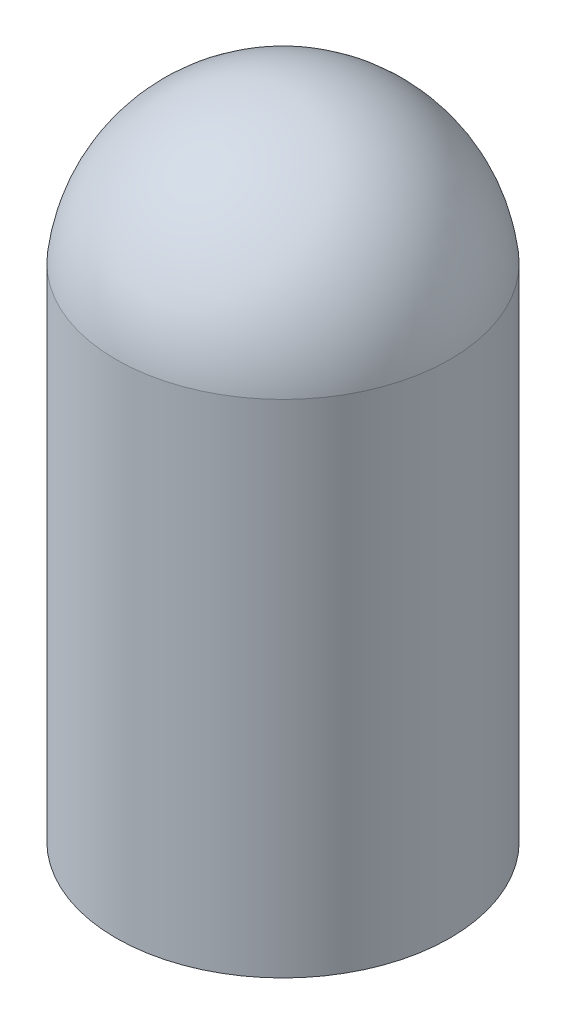
ISO-10303-21;
HEADER;
FILE_DESCRIPTION(('STEP AP214'),'2;1');
FILE_NAME('part.step','',(''),(''),'','','');
FILE_SCHEMA(('AUTOMOTIVE_DESIGN { 1 0 10303 214 1 1 1 1 }'));
ENDSEC;
DATA;
#1=APPLICATION_CONTEXT('core data for automotive mechanical design processes');
#2=APPLICATION_PROTOCOL_DEFINITION('international standard','automotive_design',2000,#1);
#3=PRODUCT_CONTEXT('',#1,'mechanical');
#4=PRODUCT('Part','Part','',(#3));
#5=PRODUCT_RELATED_PRODUCT_CATEGORY('part','',(#4));
#6=PRODUCT_DEFINITION_FORMATION('','',#4);
#7=PRODUCT_DEFINITION_CONTEXT('part definition',#1,'design');
#8=PRODUCT_DEFINITION('design','',#6,#7);
#9=PRODUCT_DEFINITION_SHAPE('','',#8);
#10=(LENGTH_UNIT() NAMED_UNIT(*) SI_UNIT(.MILLI.,.METRE.));
#11=(NAMED_UNIT(*) PLANE_ANGLE_UNIT() SI_UNIT($,.RADIAN.));
#12=(NAMED_UNIT(*) SI_UNIT($,.STERADIAN.) SOLID_ANGLE_UNIT());
#13=UNCERTAINTY_MEASURE_WITH_UNIT(LENGTH_MEASURE(1.E-05),#10,'distance_accuracy_value','');
#14=(GEOMETRIC_REPRESENTATION_CONTEXT(3) GLOBAL_UNCERTAINTY_ASSIGNED_CONTEXT((#13)) GLOBAL_UNIT_ASSIGNED_CONTEXT((#10,
#11,#12)) REPRESENTATION_CONTEXT('',''));
#15=CARTESIAN_POINT('',(0.,0.,0.));
#16=DIRECTION('',(0.,0.,1.));
#17=DIRECTION('',(1.,0.,0.));
#18=AXIS2_PLACEMENT_3D('',#15,#16,#17);
#19=CARTESIAN_POINT('',(0.,152.4,0.));
#20=DIRECTION('',(0.,-1.,0.));
#21=DIRECTION('',(0.,0.,-1.));
#22=AXIS2_PLACEMENT_3D('',#19,#20,#21);
#23=CYLINDRICAL_SURFACE('',#22,50.8);
#24=CARTESIAN_POINT('',(0.,152.4,0.));
#25=DIRECTION('',(0.,1.,0.));
#26=DIRECTION('',(0.,0.,1.));
#27=AXIS2_PLACEMENT_3D('',#24,#25,#26);
#28=CIRCLE('',#27,50.8);
#29=CARTESIAN_POINT('',(0.,152.4,50.8));
#30=VERTEX_POINT('',#29);
#31=EDGE_CURVE('E10',#30,#30,#28,.T.);
#32=ORIENTED_EDGE('',*,*,#31,.F.);
#33=EDGE_LOOP('',(#32));
#34=FACE_BOUND('',#33,.T.);
#35=CARTESIAN_POINT('',(0.,0.,0.));
#36=DIRECTION('',(0.,1.,0.));
#37=DIRECTION('',(0.,0.,1.));
#38=AXIS2_PLACEMENT_3D('',#35,#36,#37);
#39=CIRCLE('',#38,50.8);
#40=CARTESIAN_POINT('',(0.,0.,50.8));
#41=VERTEX_POINT('',#40);
#42=EDGE_CURVE('E35',#41,#41,#39,.T.);
#43=ORIENTED_EDGE('',*,*,#42,.T.);
#44=EDGE_LOOP('',(#43));
#45=FACE_BOUND('',#44,.T.);
#46=ADVANCED_FACE('F28',(#34,#45),#23,.T.);
#47=CARTESIAN_POINT('',(0.,147.037777777778,0.));
#48=DIRECTION('',(0.,0.,1.));
#49=DIRECTION('',(1.,0.,0.));
#50=AXIS2_PLACEMENT_3D('',#47,#48,#49);
#51=SPHERICAL_SURFACE('',#50,51.0822222222222);
#52=CARTESIAN_POINT('',(0.,147.037777777778,0.));
#53=DIRECTION('',(0.,1.,0.));
#54=DIRECTION('',(0.,0.,1.));
#55=AXIS2_PLACEMENT_3D('',#52,#53,#54);
#56=SPHERICAL_SURFACE('',#55,51.0822222222222);
#57=ORIENTED_EDGE('',*,*,#31,.T.);
#58=EDGE_LOOP('',(#57));
#59=FACE_BOUND('',#58,.T.);
#60=ADVANCED_FACE('F30',(#59),#56,.T.);
#61=CARTESIAN_POINT('',(0.,0.,0.));
#62=DIRECTION('',(0.,1.,0.));
#63=DIRECTION('',(0.,0.,1.));
#64=AXIS2_PLACEMENT_3D('',#61,#62,#63);
#65=PLANE('',#64);
#66=ORIENTED_EDGE('',*,*,#42,.F.);
#67=EDGE_LOOP('',(#66));
#68=FACE_BOUND('',#67,.T.);
#69=ADVANCED_FACE('F42',(#68),#65,.F.);
#70=CLOSED_SHELL('',(#46,#60,#69));
#71=MANIFOLD_SOLID_BREP('B2',#70);
#72=ADVANCED_BREP_SHAPE_REPRESENTATION('',(#18,#71),#14);
#73=SHAPE_DEFINITION_REPRESENTATION(#9,#72);
ENDSEC;
END-ISO-10303-21;
